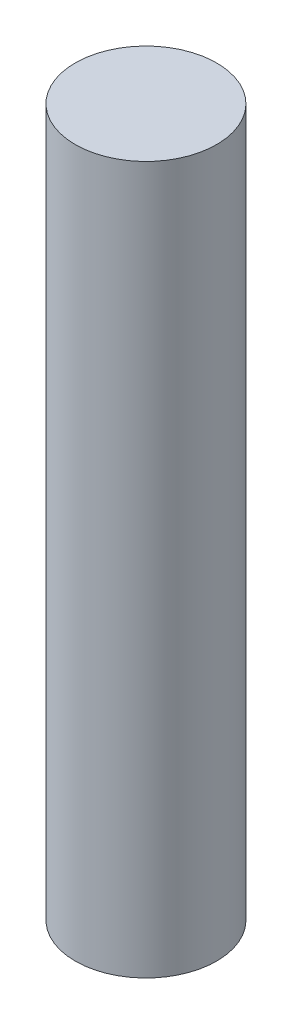
ISO-10303-21;
HEADER;
FILE_DESCRIPTION(('STEP AP214'),'2;1');
FILE_NAME('part.step','',(''),(''),'','','');
FILE_SCHEMA(('AUTOMOTIVE_DESIGN { 1 0 10303 214 1 1 1 1 }'));
ENDSEC;
DATA;
#1=APPLICATION_CONTEXT('core data for automotive mechanical design processes');
#2=APPLICATION_PROTOCOL_DEFINITION('international standard','automotive_design',2000,#1);
#3=PRODUCT_CONTEXT('',#1,'mechanical');
#4=PRODUCT('Part','Part','',(#3));
#5=PRODUCT_RELATED_PRODUCT_CATEGORY('part','',(#4));
#6=PRODUCT_DEFINITION_FORMATION('','',#4);
#7=PRODUCT_DEFINITION_CONTEXT('part definition',#1,'design');
#8=PRODUCT_DEFINITION('design','',#6,#7);
#9=PRODUCT_DEFINITION_SHAPE('','',#8);
#10=(LENGTH_UNIT() NAMED_UNIT(*) SI_UNIT(.MILLI.,.METRE.));
#11=(NAMED_UNIT(*) PLANE_ANGLE_UNIT() SI_UNIT($,.RADIAN.));
#12=(NAMED_UNIT(*) SI_UNIT($,.STERADIAN.) SOLID_ANGLE_UNIT());
#13=UNCERTAINTY_MEASURE_WITH_UNIT(LENGTH_MEASURE(1.E-05),#10,'distance_accuracy_value','');
#14=(GEOMETRIC_REPRESENTATION_CONTEXT(3) GLOBAL_UNCERTAINTY_ASSIGNED_CONTEXT((#13)) GLOBAL_UNIT_ASSIGNED_CONTEXT((#10,
#11,#12)) REPRESENTATION_CONTEXT('',''));
#15=CARTESIAN_POINT('',(0.,0.,0.));
#16=DIRECTION('',(0.,0.,1.));
#17=DIRECTION('',(1.,0.,0.));
#18=AXIS2_PLACEMENT_3D('',#15,#16,#17);
#19=CARTESIAN_POINT('',(0.,50.,0.));
#20=DIRECTION('',(0.,-1.,0.));
#21=DIRECTION('',(0.,0.,-1.));
#22=AXIS2_PLACEMENT_3D('',#19,#20,#21);
#23=CYLINDRICAL_SURFACE('',#22,5.);
#24=CARTESIAN_POINT('',(0.,50.,0.));
#25=DIRECTION('',(0.,1.,0.));
#26=DIRECTION('',(0.,0.,1.));
#27=AXIS2_PLACEMENT_3D('',#24,#25,#26);
#28=CIRCLE('',#27,5.);
#29=CARTESIAN_POINT('',(0.,50.,5.));
#30=VERTEX_POINT('',#29);
#31=EDGE_CURVE('E10',#30,#30,#28,.T.);
#32=ORIENTED_EDGE('',*,*,#31,.F.);
#33=EDGE_LOOP('',(#32));
#34=FACE_BOUND('',#33,.T.);
#35=CARTESIAN_POINT('',(0.,0.,0.));
#36=DIRECTION('',(0.,1.,0.));
#37=DIRECTION('',(0.,0.,1.));
#38=AXIS2_PLACEMENT_3D('',#35,#36,#37);
#39=CIRCLE('',#38,5.);
#40=CARTESIAN_POINT('',(0.,0.,5.));
#41=VERTEX_POINT('',#40);
#42=EDGE_CURVE('E33',#41,#41,#39,.T.);
#43=ORIENTED_EDGE('',*,*,#42,.T.);
#44=EDGE_LOOP('',(#43));
#45=FACE_BOUND('',#44,.T.);
#46=ADVANCED_FACE('F30',(#34,#45),#23,.T.);
#47=CARTESIAN_POINT('',(0.,50.,0.));
#48=DIRECTION('',(0.,1.,0.));
#49=DIRECTION('',(0.,0.,1.));
#50=AXIS2_PLACEMENT_3D('',#47,#48,#49);
#51=PLANE('',#50);
#52=ORIENTED_EDGE('',*,*,#31,.T.);
#53=EDGE_LOOP('',(#52));
#54=FACE_BOUND('',#53,.T.);
#55=ADVANCED_FACE('F45',(#54),#51,.T.);
#56=CARTESIAN_POINT('',(0.,0.,0.));
#57=DIRECTION('',(0.,1.,0.));
#58=DIRECTION('',(0.,0.,1.));
#59=AXIS2_PLACEMENT_3D('',#56,#57,#58);
#60=PLANE('',#59);
#61=ORIENTED_EDGE('',*,*,#42,.F.);
#62=EDGE_LOOP('',(#61));
#63=FACE_BOUND('',#62,.T.);
#64=ADVANCED_FACE('F43',(#63),#60,.F.);
#65=CLOSED_SHELL('',(#46,#55,#64));
#66=MANIFOLD_SOLID_BREP('B2',#65);
#67=ADVANCED_BREP_SHAPE_REPRESENTATION('',(#18,#66),#14);
#68=SHAPE_DEFINITION_REPRESENTATION(#9,#67);
ENDSEC;
END-ISO-10303-21;
